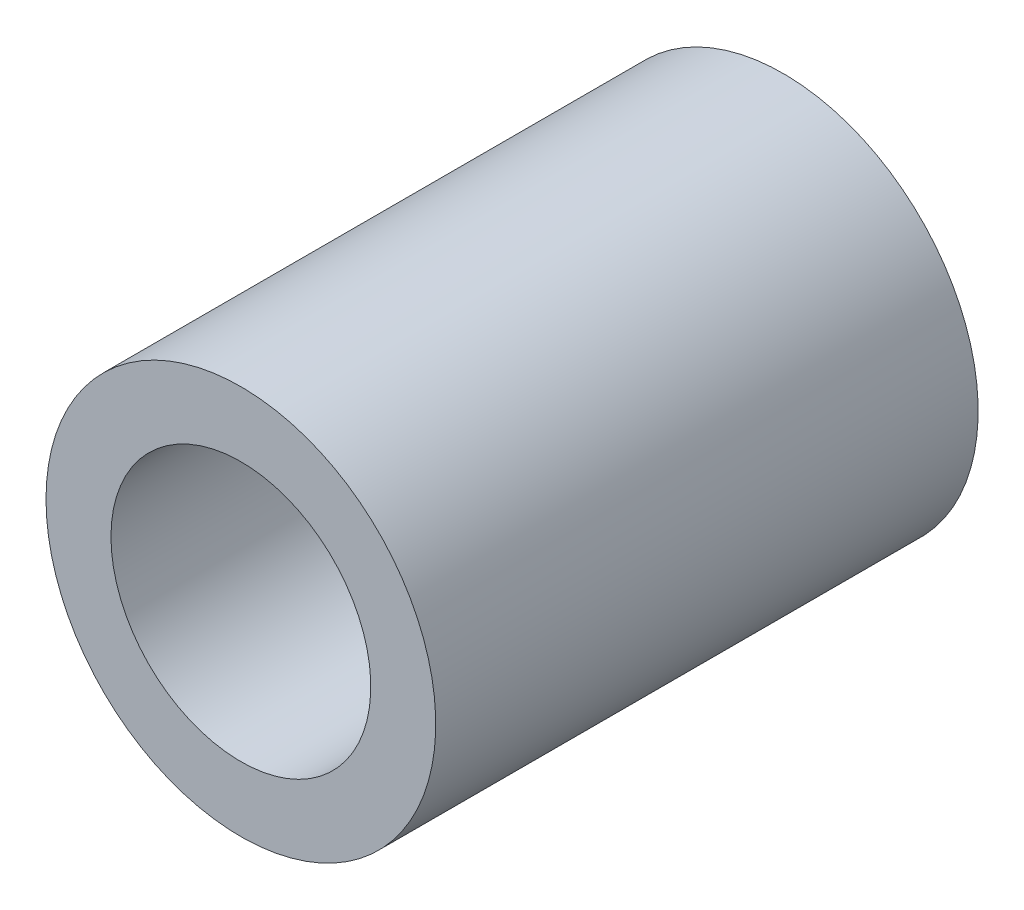
ISO-10303-21;
HEADER;
FILE_DESCRIPTION(('STEP AP214'),'2;1');
FILE_NAME('part.step','',(''),(''),'','','');
FILE_SCHEMA(('AUTOMOTIVE_DESIGN { 1 0 10303 214 1 1 1 1 }'));
ENDSEC;
DATA;
#1=APPLICATION_CONTEXT('core data for automotive mechanical design processes');
#2=APPLICATION_PROTOCOL_DEFINITION('international standard','automotive_design',2000,#1);
#3=PRODUCT_CONTEXT('',#1,'mechanical');
#4=PRODUCT('Part','Part','',(#3));
#5=PRODUCT_RELATED_PRODUCT_CATEGORY('part','',(#4));
#6=PRODUCT_DEFINITION_FORMATION('','',#4);
#7=PRODUCT_DEFINITION_CONTEXT('part definition',#1,'design');
#8=PRODUCT_DEFINITION('design','',#6,#7);
#9=PRODUCT_DEFINITION_SHAPE('','',#8);
#10=(LENGTH_UNIT() NAMED_UNIT(*) SI_UNIT(.MILLI.,.METRE.));
#11=(NAMED_UNIT(*) PLANE_ANGLE_UNIT() SI_UNIT($,.RADIAN.));
#12=(NAMED_UNIT(*) SI_UNIT($,.STERADIAN.) SOLID_ANGLE_UNIT());
#13=UNCERTAINTY_MEASURE_WITH_UNIT(LENGTH_MEASURE(1.E-05),#10,'distance_accuracy_value','');
#14=(GEOMETRIC_REPRESENTATION_CONTEXT(3) GLOBAL_UNCERTAINTY_ASSIGNED_CONTEXT((#13)) GLOBAL_UNIT_ASSIGNED_CONTEXT((#10,
#11,#12)) REPRESENTATION_CONTEXT('',''));
#15=CARTESIAN_POINT('',(0.,0.,0.));
#16=DIRECTION('',(0.,0.,1.));
#17=DIRECTION('',(1.,0.,0.));
#18=AXIS2_PLACEMENT_3D('',#15,#16,#17);
#19=CARTESIAN_POINT('',(31.63,-2.,-0.01));
#20=DIRECTION('',(0.,0.,-1.));
#21=DIRECTION('',(-1.,0.,0.));
#22=AXIS2_PLACEMENT_3D('',#19,#20,#21);
#23=CYLINDRICAL_SURFACE('',#22,0.4);
#24=CARTESIAN_POINT('',(31.63,-2.,1.66));
#25=DIRECTION('',(0.,0.,-1.));
#26=DIRECTION('',(-1.,0.,0.));
#27=AXIS2_PLACEMENT_3D('',#24,#25,#26);
#28=CIRCLE('',#27,0.4);
#29=CARTESIAN_POINT('',(31.23,-2.,1.66));
#30=VERTEX_POINT('',#29);
#31=EDGE_CURVE('E27',#30,#30,#28,.T.);
#32=ORIENTED_EDGE('',*,*,#31,.F.);
#33=EDGE_LOOP('',(#32));
#34=FACE_BOUND('',#33,.T.);
#35=CARTESIAN_POINT('',(31.63,-2.,-0.01));
#36=DIRECTION('',(0.,0.,-1.));
#37=DIRECTION('',(-1.,0.,0.));
#38=AXIS2_PLACEMENT_3D('',#35,#36,#37);
#39=CIRCLE('',#38,0.4);
#40=CARTESIAN_POINT('',(31.23,-2.,-0.01));
#41=VERTEX_POINT('',#40);
#42=EDGE_CURVE('E18',#41,#41,#39,.T.);
#43=ORIENTED_EDGE('',*,*,#42,.T.);
#44=EDGE_LOOP('',(#43));
#45=FACE_BOUND('',#44,.T.);
#46=ADVANCED_FACE('F15',(#34,#45),#23,.F.);
#47=CARTESIAN_POINT('',(31.63,-2.,-0.01));
#48=DIRECTION('',(0.,0.,1.));
#49=DIRECTION('',(1.,0.,0.));
#50=AXIS2_PLACEMENT_3D('',#47,#48,#49);
#51=PLANE('',#50);
#52=ORIENTED_EDGE('',*,*,#42,.F.);
#53=EDGE_LOOP('',(#52));
#54=FACE_BOUND('',#53,.T.);
#55=CARTESIAN_POINT('',(31.63,-2.,-0.01));
#56=DIRECTION('',(0.,0.,-1.));
#57=DIRECTION('',(-1.,0.,0.));
#58=AXIS2_PLACEMENT_3D('',#55,#56,#57);
#59=CIRCLE('',#58,0.6);
#60=CARTESIAN_POINT('',(31.03,-2.,-0.01));
#61=VERTEX_POINT('',#60);
#62=EDGE_CURVE('E22',#61,#61,#59,.F.);
#63=ORIENTED_EDGE('',*,*,#62,.F.);
#64=EDGE_LOOP('',(#63));
#65=FACE_BOUND('',#64,.T.);
#66=ADVANCED_FACE('F36',(#54,#65),#51,.F.);
#67=CARTESIAN_POINT('',(31.63,-2.,1.66));
#68=DIRECTION('',(0.,0.,1.));
#69=DIRECTION('',(1.,0.,0.));
#70=AXIS2_PLACEMENT_3D('',#67,#68,#69);
#71=PLANE('',#70);
#72=ORIENTED_EDGE('',*,*,#31,.T.);
#73=EDGE_LOOP('',(#72));
#74=FACE_BOUND('',#73,.T.);
#75=CARTESIAN_POINT('',(31.63,-2.,1.66));
#76=DIRECTION('',(0.,0.,-1.));
#77=DIRECTION('',(-1.,0.,0.));
#78=AXIS2_PLACEMENT_3D('',#75,#76,#77);
#79=CIRCLE('',#78,0.6);
#80=CARTESIAN_POINT('',(31.03,-2.,1.66));
#81=VERTEX_POINT('',#80);
#82=EDGE_CURVE('E10',#81,#81,#79,.T.);
#83=ORIENTED_EDGE('',*,*,#82,.F.);
#84=EDGE_LOOP('',(#83));
#85=FACE_BOUND('',#84,.T.);
#86=ADVANCED_FACE('F39',(#74,#85),#71,.T.);
#87=CARTESIAN_POINT('',(31.63,-2.,-0.01));
#88=DIRECTION('',(0.,0.,-1.));
#89=DIRECTION('',(-1.,0.,0.));
#90=AXIS2_PLACEMENT_3D('',#87,#88,#89);
#91=CYLINDRICAL_SURFACE('',#90,0.6);
#92=ORIENTED_EDGE('',*,*,#82,.T.);
#93=EDGE_LOOP('',(#92));
#94=FACE_BOUND('',#93,.T.);
#95=ORIENTED_EDGE('',*,*,#62,.T.);
#96=EDGE_LOOP('',(#95));
#97=FACE_BOUND('',#96,.T.);
#98=ADVANCED_FACE('F42',(#94,#97),#91,.T.);
#99=CLOSED_SHELL('',(#46,#66,#86,#98));
#100=MANIFOLD_SOLID_BREP('B1',#99);
#101=ADVANCED_BREP_SHAPE_REPRESENTATION('',(#18,#100),#14);
#102=SHAPE_DEFINITION_REPRESENTATION(#9,#101);
ENDSEC;
END-ISO-10303-21;
